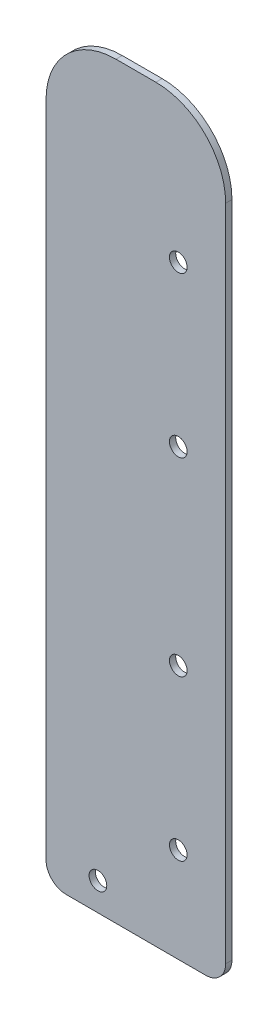
ISO-10303-21;
HEADER;
FILE_DESCRIPTION(('STEP AP214'),'2;1');
FILE_NAME('part.step','',(''),(''),'','','');
FILE_SCHEMA(('AUTOMOTIVE_DESIGN { 1 0 10303 214 1 1 1 1 }'));
ENDSEC;
DATA;
#1=APPLICATION_CONTEXT('core data for automotive mechanical design processes');
#2=APPLICATION_PROTOCOL_DEFINITION('international standard','automotive_design',2000,#1);
#3=PRODUCT_CONTEXT('',#1,'mechanical');
#4=PRODUCT('Part','Part','',(#3));
#5=PRODUCT_RELATED_PRODUCT_CATEGORY('part','',(#4));
#6=PRODUCT_DEFINITION_FORMATION('','',#4);
#7=PRODUCT_DEFINITION_CONTEXT('part definition',#1,'design');
#8=PRODUCT_DEFINITION('design','',#6,#7);
#9=PRODUCT_DEFINITION_SHAPE('','',#8);
#10=(LENGTH_UNIT() NAMED_UNIT(*) SI_UNIT(.MILLI.,.METRE.));
#11=(NAMED_UNIT(*) PLANE_ANGLE_UNIT() SI_UNIT($,.RADIAN.));
#12=(NAMED_UNIT(*) SI_UNIT($,.STERADIAN.) SOLID_ANGLE_UNIT());
#13=UNCERTAINTY_MEASURE_WITH_UNIT(LENGTH_MEASURE(1.E-05),#10,'distance_accuracy_value','');
#14=(GEOMETRIC_REPRESENTATION_CONTEXT(3) GLOBAL_UNCERTAINTY_ASSIGNED_CONTEXT((#13)) GLOBAL_UNIT_ASSIGNED_CONTEXT((#10,
#11,#12)) REPRESENTATION_CONTEXT('',''));
#15=CARTESIAN_POINT('',(0.,0.,0.));
#16=DIRECTION('',(0.,0.,1.));
#17=DIRECTION('',(1.,0.,0.));
#18=AXIS2_PLACEMENT_3D('',#15,#16,#17);
#19=CARTESIAN_POINT('',(5.07970729104008,5.13453290157548,1.6002));
#20=DIRECTION('',(0.,0.,-1.));
#21=DIRECTION('',(-1.,0.,0.));
#22=AXIS2_PLACEMENT_3D('',#19,#20,#21);
#23=PLANE('',#22);
#24=DIRECTION('',(0.999998179639717,-0.0019080663645707,0.));
#25=VECTOR('',#24,1.);
#26=CARTESIAN_POINT('',(33.655,0.,1.6002));
#27=LINE('',#26,#25);
#28=CARTESIAN_POINT('',(5.07001431390806,0.0545421490057143,1.6002));
#29=VERTEX_POINT('',#28);
#30=CARTESIAN_POINT('',(33.655,0.,1.6002));
#31=VERTEX_POINT('',#30);
#32=EDGE_CURVE('E159',#29,#31,#27,.T.);
#33=ORIENTED_EDGE('',*,*,#32,.T.);
#34=DIRECTION('',(1.,0.,0.));
#35=VECTOR('',#34,1.);
#36=CARTESIAN_POINT('',(40.64,0.,1.6002));
#37=LINE('',#36,#35);
#38=CARTESIAN_POINT('',(40.64,0.,1.6002));
#39=VERTEX_POINT('',#38);
#40=EDGE_CURVE('E102',#31,#39,#37,.T.);
#41=ORIENTED_EDGE('',*,*,#40,.T.);
#42=CARTESIAN_POINT('',(40.64,5.07999999999999,1.6002));
#43=DIRECTION('',(0.,0.,1.));
#44=DIRECTION('',(1.,0.,0.));
#45=AXIS2_PLACEMENT_3D('',#42,#43,#44);
#46=CIRCLE('',#45,5.08);
#47=CARTESIAN_POINT('',(45.72,5.07999999999999,1.6002));
#48=VERTEX_POINT('',#47);
#49=EDGE_CURVE('E177',#39,#48,#46,.T.);
#50=ORIENTED_EDGE('',*,*,#49,.T.);
#51=DIRECTION('',(0.,1.,0.));
#52=VECTOR('',#51,1.);
#53=CARTESIAN_POINT('',(45.72,5.07999999999999,1.6002));
#54=LINE('',#53,#52);
#55=CARTESIAN_POINT('',(45.72,172.72,1.6002));
#56=VERTEX_POINT('',#55);
#57=EDGE_CURVE('E194',#48,#56,#54,.T.);
#58=ORIENTED_EDGE('',*,*,#57,.T.);
#59=CARTESIAN_POINT('',(27.94,172.72,1.6002));
#60=DIRECTION('',(0.,0.,1.));
#61=DIRECTION('',(1.,0.,0.));
#62=AXIS2_PLACEMENT_3D('',#59,#60,#61);
#63=CIRCLE('',#62,17.78);
#64=CARTESIAN_POINT('',(27.94,190.5,1.6002));
#65=VERTEX_POINT('',#64);
#66=EDGE_CURVE('E193',#56,#65,#63,.T.);
#67=ORIENTED_EDGE('',*,*,#66,.T.);
#68=DIRECTION('',(-1.,0.,0.));
#69=VECTOR('',#68,1.);
#70=CARTESIAN_POINT('',(17.78,190.5,1.6002));
#71=LINE('',#70,#69);
#72=CARTESIAN_POINT('',(17.78,190.5,1.6002));
#73=VERTEX_POINT('',#72);
#74=EDGE_CURVE('E124',#65,#73,#71,.T.);
#75=ORIENTED_EDGE('',*,*,#74,.T.);
#76=CARTESIAN_POINT('',(17.78,172.72,1.6002));
#77=DIRECTION('',(0.,0.,1.));
#78=DIRECTION('',(-1.,0.,0.));
#79=AXIS2_PLACEMENT_3D('',#76,#77,#78);
#80=CIRCLE('',#79,17.78);
#81=CARTESIAN_POINT('',(0.,172.72,1.6002));
#82=VERTEX_POINT('',#81);
#83=EDGE_CURVE('E118',#73,#82,#80,.T.);
#84=ORIENTED_EDGE('',*,*,#83,.T.);
#85=DIRECTION('',(0.,-1.,0.));
#86=VECTOR('',#85,1.);
#87=CARTESIAN_POINT('',(0.,5.08000000000003,1.6002));
#88=LINE('',#87,#86);
#89=CARTESIAN_POINT('',(0.,5.08000000000003,1.6002));
#90=VERTEX_POINT('',#89);
#91=EDGE_CURVE('E122',#82,#90,#88,.T.);
#92=ORIENTED_EDGE('',*,*,#91,.T.);
#93=CARTESIAN_POINT('',(5.07970729104008,5.13453290157548,1.6002));
#94=DIRECTION('',(0.,0.,1.));
#95=DIRECTION('',(-1.,0.,0.));
#96=AXIS2_PLACEMENT_3D('',#93,#94,#95);
#97=CIRCLE('',#96,5.08);
#98=EDGE_CURVE('E56',#90,#29,#97,.T.);
#99=ORIENTED_EDGE('',*,*,#98,.T.);
#100=EDGE_LOOP('',(#33,#41,#50,#58,#67,#75,#84,#92,#99));
#101=FACE_BOUND('',#100,.T.);
#102=CARTESIAN_POINT('',(33.655,24.13,1.6002));
#103=DIRECTION('',(0.,0.,1.));
#104=DIRECTION('',(1.,0.,0.));
#105=AXIS2_PLACEMENT_3D('',#102,#103,#104);
#106=CIRCLE('',#105,2.2479);
#107=CARTESIAN_POINT('',(35.9029,24.13,1.6002));
#108=VERTEX_POINT('',#107);
#109=EDGE_CURVE('E146',#108,#108,#106,.T.);
#110=ORIENTED_EDGE('',*,*,#109,.F.);
#111=EDGE_LOOP('',(#110));
#112=FACE_BOUND('',#111,.T.);
#113=CARTESIAN_POINT('',(33.655,64.77,1.6002));
#114=DIRECTION('',(0.,0.,1.));
#115=DIRECTION('',(1.,0.,0.));
#116=AXIS2_PLACEMENT_3D('',#113,#114,#115);
#117=CIRCLE('',#116,2.2479);
#118=CARTESIAN_POINT('',(35.9029,64.77,1.6002));
#119=VERTEX_POINT('',#118);
#120=EDGE_CURVE('E204',#119,#119,#117,.T.);
#121=ORIENTED_EDGE('',*,*,#120,.F.);
#122=EDGE_LOOP('',(#121));
#123=FACE_BOUND('',#122,.T.);
#124=CARTESIAN_POINT('',(13.208,7.15102725040235,1.6002));
#125=DIRECTION('',(0.,0.,1.));
#126=DIRECTION('',(1.,0.,0.));
#127=AXIS2_PLACEMENT_3D('',#124,#125,#126);
#128=CIRCLE('',#127,2.2479);
#129=CARTESIAN_POINT('',(15.4559,7.15102725040235,1.6002));
#130=VERTEX_POINT('',#129);
#131=EDGE_CURVE('E210',#130,#130,#128,.T.);
#132=ORIENTED_EDGE('',*,*,#131,.F.);
#133=EDGE_LOOP('',(#132));
#134=FACE_BOUND('',#133,.T.);
#135=CARTESIAN_POINT('',(33.655,113.03,1.6002));
#136=DIRECTION('',(0.,0.,1.));
#137=DIRECTION('',(1.,0.,0.));
#138=AXIS2_PLACEMENT_3D('',#135,#136,#137);
#139=CIRCLE('',#138,2.2479);
#140=CARTESIAN_POINT('',(35.9029,113.03,1.6002));
#141=VERTEX_POINT('',#140);
#142=EDGE_CURVE('E216',#141,#141,#139,.T.);
#143=ORIENTED_EDGE('',*,*,#142,.F.);
#144=EDGE_LOOP('',(#143));
#145=FACE_BOUND('',#144,.T.);
#146=CARTESIAN_POINT('',(33.655,153.67,1.6002));
#147=DIRECTION('',(0.,0.,1.));
#148=DIRECTION('',(1.,0.,0.));
#149=AXIS2_PLACEMENT_3D('',#146,#147,#148);
#150=CIRCLE('',#149,2.24790000000001);
#151=CARTESIAN_POINT('',(35.9029,153.67,1.6002));
#152=VERTEX_POINT('',#151);
#153=EDGE_CURVE('E222',#152,#152,#150,.T.);
#154=ORIENTED_EDGE('',*,*,#153,.F.);
#155=EDGE_LOOP('',(#154));
#156=FACE_BOUND('',#155,.T.);
#157=ADVANCED_FACE('F39',(#101,#112,#123,#134,#145,#156),#23,.F.);
#158=CARTESIAN_POINT('',(5.07970729104008,5.13453290157548,0.));
#159=DIRECTION('',(0.,0.,-1.));
#160=DIRECTION('',(-1.,0.,0.));
#161=AXIS2_PLACEMENT_3D('',#158,#159,#160);
#162=PLANE('',#161);
#163=CARTESIAN_POINT('',(33.655,113.03,0.));
#164=DIRECTION('',(0.,0.,1.));
#165=DIRECTION('',(1.,0.,0.));
#166=AXIS2_PLACEMENT_3D('',#163,#164,#165);
#167=CIRCLE('',#166,2.2479);
#168=CARTESIAN_POINT('',(35.9029,113.03,0.));
#169=VERTEX_POINT('',#168);
#170=EDGE_CURVE('E219',#169,#169,#167,.T.);
#171=ORIENTED_EDGE('',*,*,#170,.T.);
#172=EDGE_LOOP('',(#171));
#173=FACE_BOUND('',#172,.T.);
#174=CARTESIAN_POINT('',(33.655,64.77,0.));
#175=DIRECTION('',(0.,0.,1.));
#176=DIRECTION('',(1.,0.,0.));
#177=AXIS2_PLACEMENT_3D('',#174,#175,#176);
#178=CIRCLE('',#177,2.2479);
#179=CARTESIAN_POINT('',(35.9029,64.77,0.));
#180=VERTEX_POINT('',#179);
#181=EDGE_CURVE('E207',#180,#180,#178,.T.);
#182=ORIENTED_EDGE('',*,*,#181,.T.);
#183=EDGE_LOOP('',(#182));
#184=FACE_BOUND('',#183,.T.);
#185=DIRECTION('',(0.999998179639717,-0.0019080663645707,0.));
#186=VECTOR('',#185,1.);
#187=CARTESIAN_POINT('',(33.655,0.,0.));
#188=LINE('',#187,#186);
#189=CARTESIAN_POINT('',(5.07001431390806,0.0545421490057143,0.));
#190=VERTEX_POINT('',#189);
#191=CARTESIAN_POINT('',(33.655,0.,0.));
#192=VERTEX_POINT('',#191);
#193=EDGE_CURVE('E142',#190,#192,#188,.T.);
#194=ORIENTED_EDGE('',*,*,#193,.F.);
#195=CARTESIAN_POINT('',(5.07970729104008,5.13453290157548,0.));
#196=DIRECTION('',(0.,0.,1.));
#197=DIRECTION('',(-1.,0.,0.));
#198=AXIS2_PLACEMENT_3D('',#195,#196,#197);
#199=CIRCLE('',#198,5.08);
#200=CARTESIAN_POINT('',(0.,5.08000000000003,0.));
#201=VERTEX_POINT('',#200);
#202=EDGE_CURVE('E94',#201,#190,#199,.T.);
#203=ORIENTED_EDGE('',*,*,#202,.F.);
#204=DIRECTION('',(0.,-1.,0.));
#205=VECTOR('',#204,1.);
#206=CARTESIAN_POINT('',(0.,5.08000000000003,0.));
#207=LINE('',#206,#205);
#208=CARTESIAN_POINT('',(0.,172.72,0.));
#209=VERTEX_POINT('',#208);
#210=EDGE_CURVE('E88',#209,#201,#207,.T.);
#211=ORIENTED_EDGE('',*,*,#210,.F.);
#212=CARTESIAN_POINT('',(17.78,172.72,0.));
#213=DIRECTION('',(0.,0.,1.));
#214=DIRECTION('',(-1.,0.,0.));
#215=AXIS2_PLACEMENT_3D('',#212,#213,#214);
#216=CIRCLE('',#215,17.78);
#217=CARTESIAN_POINT('',(17.78,190.5,0.));
#218=VERTEX_POINT('',#217);
#219=EDGE_CURVE('E132',#218,#209,#216,.T.);
#220=ORIENTED_EDGE('',*,*,#219,.F.);
#221=DIRECTION('',(-1.,0.,0.));
#222=VECTOR('',#221,1.);
#223=CARTESIAN_POINT('',(17.78,190.5,0.));
#224=LINE('',#223,#222);
#225=CARTESIAN_POINT('',(27.94,190.5,0.));
#226=VERTEX_POINT('',#225);
#227=EDGE_CURVE('E154',#226,#218,#224,.T.);
#228=ORIENTED_EDGE('',*,*,#227,.F.);
#229=CARTESIAN_POINT('',(27.94,172.72,0.));
#230=DIRECTION('',(0.,0.,1.));
#231=DIRECTION('',(1.,0.,0.));
#232=AXIS2_PLACEMENT_3D('',#229,#230,#231);
#233=CIRCLE('',#232,17.78);
#234=CARTESIAN_POINT('',(45.72,172.72,0.));
#235=VERTEX_POINT('',#234);
#236=EDGE_CURVE('E152',#235,#226,#233,.T.);
#237=ORIENTED_EDGE('',*,*,#236,.F.);
#238=DIRECTION('',(0.,1.,0.));
#239=VECTOR('',#238,1.);
#240=CARTESIAN_POINT('',(45.72,5.07999999999999,0.));
#241=LINE('',#240,#239);
#242=CARTESIAN_POINT('',(45.72,5.07999999999999,0.));
#243=VERTEX_POINT('',#242);
#244=EDGE_CURVE('E150',#243,#235,#241,.T.);
#245=ORIENTED_EDGE('',*,*,#244,.F.);
#246=CARTESIAN_POINT('',(40.64,5.07999999999999,0.));
#247=DIRECTION('',(0.,0.,1.));
#248=DIRECTION('',(1.,0.,0.));
#249=AXIS2_PLACEMENT_3D('',#246,#247,#248);
#250=CIRCLE('',#249,5.08);
#251=CARTESIAN_POINT('',(40.64,0.,0.));
#252=VERTEX_POINT('',#251);
#253=EDGE_CURVE('E148',#252,#243,#250,.T.);
#254=ORIENTED_EDGE('',*,*,#253,.F.);
#255=DIRECTION('',(1.,0.,0.));
#256=VECTOR('',#255,1.);
#257=CARTESIAN_POINT('',(40.64,0.,0.));
#258=LINE('',#257,#256);
#259=EDGE_CURVE('E145',#192,#252,#258,.T.);
#260=ORIENTED_EDGE('',*,*,#259,.F.);
#261=EDGE_LOOP('',(#194,#203,#211,#220,#228,#237,#245,#254,#260));
#262=FACE_BOUND('',#261,.T.);
#263=CARTESIAN_POINT('',(33.655,24.13,0.));
#264=DIRECTION('',(0.,0.,1.));
#265=DIRECTION('',(1.,0.,0.));
#266=AXIS2_PLACEMENT_3D('',#263,#264,#265);
#267=CIRCLE('',#266,2.2479);
#268=CARTESIAN_POINT('',(35.9029,24.13,0.));
#269=VERTEX_POINT('',#268);
#270=EDGE_CURVE('E201',#269,#269,#267,.T.);
#271=ORIENTED_EDGE('',*,*,#270,.T.);
#272=EDGE_LOOP('',(#271));
#273=FACE_BOUND('',#272,.T.);
#274=CARTESIAN_POINT('',(13.208,7.15102725040235,0.));
#275=DIRECTION('',(0.,0.,1.));
#276=DIRECTION('',(1.,0.,0.));
#277=AXIS2_PLACEMENT_3D('',#274,#275,#276);
#278=CIRCLE('',#277,2.2479);
#279=CARTESIAN_POINT('',(15.4559,7.15102725040235,0.));
#280=VERTEX_POINT('',#279);
#281=EDGE_CURVE('E213',#280,#280,#278,.T.);
#282=ORIENTED_EDGE('',*,*,#281,.T.);
#283=EDGE_LOOP('',(#282));
#284=FACE_BOUND('',#283,.T.);
#285=CARTESIAN_POINT('',(33.655,153.67,0.));
#286=DIRECTION('',(0.,0.,1.));
#287=DIRECTION('',(1.,0.,0.));
#288=AXIS2_PLACEMENT_3D('',#285,#286,#287);
#289=CIRCLE('',#288,2.24790000000001);
#290=CARTESIAN_POINT('',(35.9029,153.67,0.));
#291=VERTEX_POINT('',#290);
#292=EDGE_CURVE('E225',#291,#291,#289,.T.);
#293=ORIENTED_EDGE('',*,*,#292,.T.);
#294=EDGE_LOOP('',(#293));
#295=FACE_BOUND('',#294,.T.);
#296=ADVANCED_FACE('F181',(#173,#184,#262,#273,#284,#295),#162,.T.);
#297=CARTESIAN_POINT('',(33.655,0.,1.6002));
#298=DIRECTION('',(0.0019080663645707,0.999998179639717,0.));
#299=DIRECTION('',(-0.999998179639717,0.0019080663645707,0.));
#300=AXIS2_PLACEMENT_3D('',#297,#298,#299);
#301=PLANE('',#300);
#302=ORIENTED_EDGE('',*,*,#193,.T.);
#303=DIRECTION('',(0.,0.,-1.));
#304=VECTOR('',#303,1.);
#305=CARTESIAN_POINT('',(33.655,0.,1.6002));
#306=LINE('',#305,#304);
#307=EDGE_CURVE('E11',#31,#192,#306,.T.);
#308=ORIENTED_EDGE('',*,*,#307,.F.);
#309=ORIENTED_EDGE('',*,*,#32,.F.);
#310=DIRECTION('',(0.,0.,-1.));
#311=VECTOR('',#310,1.);
#312=CARTESIAN_POINT('',(5.07001431390806,0.0545421490057143,1.6002));
#313=LINE('',#312,#311);
#314=EDGE_CURVE('E138',#29,#190,#313,.T.);
#315=ORIENTED_EDGE('',*,*,#314,.T.);
#316=EDGE_LOOP('',(#302,#308,#309,#315));
#317=FACE_BOUND('',#316,.T.);
#318=ADVANCED_FACE('F41',(#317),#301,.F.);
#319=CARTESIAN_POINT('',(40.64,0.,1.6002));
#320=DIRECTION('',(0.,1.,0.));
#321=DIRECTION('',(-1.,0.,0.));
#322=AXIS2_PLACEMENT_3D('',#319,#320,#321);
#323=PLANE('',#322);
#324=ORIENTED_EDGE('',*,*,#259,.T.);
#325=DIRECTION('',(0.,0.,-1.));
#326=VECTOR('',#325,1.);
#327=CARTESIAN_POINT('',(40.64,0.,1.6002));
#328=LINE('',#327,#326);
#329=EDGE_CURVE('E48',#39,#252,#328,.T.);
#330=ORIENTED_EDGE('',*,*,#329,.F.);
#331=ORIENTED_EDGE('',*,*,#40,.F.);
#332=ORIENTED_EDGE('',*,*,#307,.T.);
#333=EDGE_LOOP('',(#324,#330,#331,#332));
#334=FACE_BOUND('',#333,.T.);
#335=ADVANCED_FACE('F261',(#334),#323,.F.);
#336=CARTESIAN_POINT('',(40.64,5.07999999999999,1.6002));
#337=DIRECTION('',(0.,0.,-1.));
#338=DIRECTION('',(-1.,0.,0.));
#339=AXIS2_PLACEMENT_3D('',#336,#337,#338);
#340=CYLINDRICAL_SURFACE('',#339,5.08);
#341=ORIENTED_EDGE('',*,*,#253,.T.);
#342=DIRECTION('',(0.,0.,-1.));
#343=VECTOR('',#342,1.);
#344=CARTESIAN_POINT('',(45.72,5.07999999999999,1.6002));
#345=LINE('',#344,#343);
#346=EDGE_CURVE('E169',#48,#243,#345,.T.);
#347=ORIENTED_EDGE('',*,*,#346,.F.);
#348=ORIENTED_EDGE('',*,*,#49,.F.);
#349=ORIENTED_EDGE('',*,*,#329,.T.);
#350=EDGE_LOOP('',(#341,#347,#348,#349));
#351=FACE_BOUND('',#350,.T.);
#352=ADVANCED_FACE('F175',(#351),#340,.T.);
#353=CARTESIAN_POINT('',(45.72,5.07999999999999,1.6002));
#354=DIRECTION('',(-1.,0.,0.));
#355=DIRECTION('',(0.,-1.,0.));
#356=AXIS2_PLACEMENT_3D('',#353,#354,#355);
#357=PLANE('',#356);
#358=ORIENTED_EDGE('',*,*,#244,.T.);
#359=DIRECTION('',(0.,0.,-1.));
#360=VECTOR('',#359,1.);
#361=CARTESIAN_POINT('',(45.72,172.72,1.6002));
#362=LINE('',#361,#360);
#363=EDGE_CURVE('E166',#56,#235,#362,.T.);
#364=ORIENTED_EDGE('',*,*,#363,.F.);
#365=ORIENTED_EDGE('',*,*,#57,.F.);
#366=ORIENTED_EDGE('',*,*,#346,.T.);
#367=EDGE_LOOP('',(#358,#364,#365,#366));
#368=FACE_BOUND('',#367,.T.);
#369=ADVANCED_FACE('F187',(#368),#357,.F.);
#370=CARTESIAN_POINT('',(27.94,172.72,1.6002));
#371=DIRECTION('',(0.,0.,-1.));
#372=DIRECTION('',(-1.,0.,0.));
#373=AXIS2_PLACEMENT_3D('',#370,#371,#372);
#374=CYLINDRICAL_SURFACE('',#373,17.78);
#375=ORIENTED_EDGE('',*,*,#236,.T.);
#376=DIRECTION('',(0.,0.,-1.));
#377=VECTOR('',#376,1.);
#378=CARTESIAN_POINT('',(27.94,190.5,1.6002));
#379=LINE('',#378,#377);
#380=EDGE_CURVE('E163',#65,#226,#379,.T.);
#381=ORIENTED_EDGE('',*,*,#380,.F.);
#382=ORIENTED_EDGE('',*,*,#66,.F.);
#383=ORIENTED_EDGE('',*,*,#363,.T.);
#384=EDGE_LOOP('',(#375,#381,#382,#383));
#385=FACE_BOUND('',#384,.T.);
#386=ADVANCED_FACE('F191',(#385),#374,.T.);
#387=CARTESIAN_POINT('',(17.78,190.5,1.6002));
#388=DIRECTION('',(0.,-1.,0.));
#389=DIRECTION('',(0.,0.,-1.));
#390=AXIS2_PLACEMENT_3D('',#387,#388,#389);
#391=PLANE('',#390);
#392=ORIENTED_EDGE('',*,*,#227,.T.);
#393=DIRECTION('',(0.,0.,-1.));
#394=VECTOR('',#393,1.);
#395=CARTESIAN_POINT('',(17.78,190.5,1.6002));
#396=LINE('',#395,#394);
#397=EDGE_CURVE('E133',#73,#218,#396,.T.);
#398=ORIENTED_EDGE('',*,*,#397,.F.);
#399=ORIENTED_EDGE('',*,*,#74,.F.);
#400=ORIENTED_EDGE('',*,*,#380,.T.);
#401=EDGE_LOOP('',(#392,#398,#399,#400));
#402=FACE_BOUND('',#401,.T.);
#403=ADVANCED_FACE('F252',(#402),#391,.F.);
#404=CARTESIAN_POINT('',(17.78,172.72,1.6002));
#405=DIRECTION('',(0.,0.,-1.));
#406=DIRECTION('',(-1.,0.,0.));
#407=AXIS2_PLACEMENT_3D('',#404,#405,#406);
#408=CYLINDRICAL_SURFACE('',#407,17.78);
#409=ORIENTED_EDGE('',*,*,#219,.T.);
#410=DIRECTION('',(0.,0.,-1.));
#411=VECTOR('',#410,1.);
#412=CARTESIAN_POINT('',(0.,172.72,1.6002));
#413=LINE('',#412,#411);
#414=EDGE_CURVE('E129',#82,#209,#413,.T.);
#415=ORIENTED_EDGE('',*,*,#414,.F.);
#416=ORIENTED_EDGE('',*,*,#83,.F.);
#417=ORIENTED_EDGE('',*,*,#397,.T.);
#418=EDGE_LOOP('',(#409,#415,#416,#417));
#419=FACE_BOUND('',#418,.T.);
#420=ADVANCED_FACE('F130',(#419),#408,.T.);
#421=CARTESIAN_POINT('',(0.,5.08000000000003,1.6002));
#422=DIRECTION('',(1.,0.,0.));
#423=DIRECTION('',(0.,0.,-1.));
#424=AXIS2_PLACEMENT_3D('',#421,#422,#423);
#425=PLANE('',#424);
#426=ORIENTED_EDGE('',*,*,#210,.T.);
#427=DIRECTION('',(0.,0.,-1.));
#428=VECTOR('',#427,1.);
#429=CARTESIAN_POINT('',(0.,5.08000000000003,1.6002));
#430=LINE('',#429,#428);
#431=EDGE_CURVE('E134',#90,#201,#430,.T.);
#432=ORIENTED_EDGE('',*,*,#431,.F.);
#433=ORIENTED_EDGE('',*,*,#91,.F.);
#434=ORIENTED_EDGE('',*,*,#414,.T.);
#435=EDGE_LOOP('',(#426,#432,#433,#434));
#436=FACE_BOUND('',#435,.T.);
#437=ADVANCED_FACE('F136',(#436),#425,.F.);
#438=CARTESIAN_POINT('',(5.07970729104008,5.13453290157548,1.6002));
#439=DIRECTION('',(0.,0.,-1.));
#440=DIRECTION('',(-1.,0.,0.));
#441=AXIS2_PLACEMENT_3D('',#438,#439,#440);
#442=CYLINDRICAL_SURFACE('',#441,5.08);
#443=ORIENTED_EDGE('',*,*,#202,.T.);
#444=ORIENTED_EDGE('',*,*,#314,.F.);
#445=ORIENTED_EDGE('',*,*,#98,.F.);
#446=ORIENTED_EDGE('',*,*,#431,.T.);
#447=EDGE_LOOP('',(#443,#444,#445,#446));
#448=FACE_BOUND('',#447,.T.);
#449=ADVANCED_FACE('F245',(#448),#442,.T.);
#450=CARTESIAN_POINT('',(33.655,24.13,1.6002));
#451=DIRECTION('',(0.,0.,-1.));
#452=DIRECTION('',(-1.,0.,0.));
#453=AXIS2_PLACEMENT_3D('',#450,#451,#452);
#454=CYLINDRICAL_SURFACE('',#453,2.2479);
#455=ORIENTED_EDGE('',*,*,#109,.T.);
#456=EDGE_LOOP('',(#455));
#457=FACE_BOUND('',#456,.T.);
#458=ORIENTED_EDGE('',*,*,#270,.F.);
#459=EDGE_LOOP('',(#458));
#460=FACE_BOUND('',#459,.T.);
#461=ADVANCED_FACE('F242',(#457,#460),#454,.F.);
#462=CARTESIAN_POINT('',(33.655,64.77,1.6002));
#463=DIRECTION('',(0.,0.,-1.));
#464=DIRECTION('',(-1.,0.,0.));
#465=AXIS2_PLACEMENT_3D('',#462,#463,#464);
#466=CYLINDRICAL_SURFACE('',#465,2.2479);
#467=ORIENTED_EDGE('',*,*,#120,.T.);
#468=EDGE_LOOP('',(#467));
#469=FACE_BOUND('',#468,.T.);
#470=ORIENTED_EDGE('',*,*,#181,.F.);
#471=EDGE_LOOP('',(#470));
#472=FACE_BOUND('',#471,.T.);
#473=ADVANCED_FACE('F335',(#469,#472),#466,.F.);
#474=CARTESIAN_POINT('',(13.208,7.15102725040235,1.6002));
#475=DIRECTION('',(0.,0.,-1.));
#476=DIRECTION('',(-1.,0.,0.));
#477=AXIS2_PLACEMENT_3D('',#474,#475,#476);
#478=CYLINDRICAL_SURFACE('',#477,2.2479);
#479=ORIENTED_EDGE('',*,*,#131,.T.);
#480=EDGE_LOOP('',(#479));
#481=FACE_BOUND('',#480,.T.);
#482=ORIENTED_EDGE('',*,*,#281,.F.);
#483=EDGE_LOOP('',(#482));
#484=FACE_BOUND('',#483,.T.);
#485=ADVANCED_FACE('F343',(#481,#484),#478,.F.);
#486=CARTESIAN_POINT('',(33.655,113.03,1.6002));
#487=DIRECTION('',(0.,0.,-1.));
#488=DIRECTION('',(-1.,0.,0.));
#489=AXIS2_PLACEMENT_3D('',#486,#487,#488);
#490=CYLINDRICAL_SURFACE('',#489,2.2479);
#491=ORIENTED_EDGE('',*,*,#142,.T.);
#492=EDGE_LOOP('',(#491));
#493=FACE_BOUND('',#492,.T.);
#494=ORIENTED_EDGE('',*,*,#170,.F.);
#495=EDGE_LOOP('',(#494));
#496=FACE_BOUND('',#495,.T.);
#497=ADVANCED_FACE('F351',(#493,#496),#490,.F.);
#498=CARTESIAN_POINT('',(33.655,153.67,1.6002));
#499=DIRECTION('',(0.,0.,-1.));
#500=DIRECTION('',(-1.,0.,0.));
#501=AXIS2_PLACEMENT_3D('',#498,#499,#500);
#502=CYLINDRICAL_SURFACE('',#501,2.24790000000001);
#503=ORIENTED_EDGE('',*,*,#153,.T.);
#504=EDGE_LOOP('',(#503));
#505=FACE_BOUND('',#504,.T.);
#506=ORIENTED_EDGE('',*,*,#292,.F.);
#507=EDGE_LOOP('',(#506));
#508=FACE_BOUND('',#507,.T.);
#509=ADVANCED_FACE('F231',(#505,#508),#502,.F.);
#510=CLOSED_SHELL('',(#157,#296,#318,#335,#352,#369,#386,#403,#420,#437,#449,#461,#473,#485,
#497,#509));
#511=MANIFOLD_SOLID_BREP('B2',#510);
#512=ADVANCED_BREP_SHAPE_REPRESENTATION('',(#18,#511),#14);
#513=SHAPE_DEFINITION_REPRESENTATION(#9,#512);
ENDSEC;
END-ISO-10303-21;
